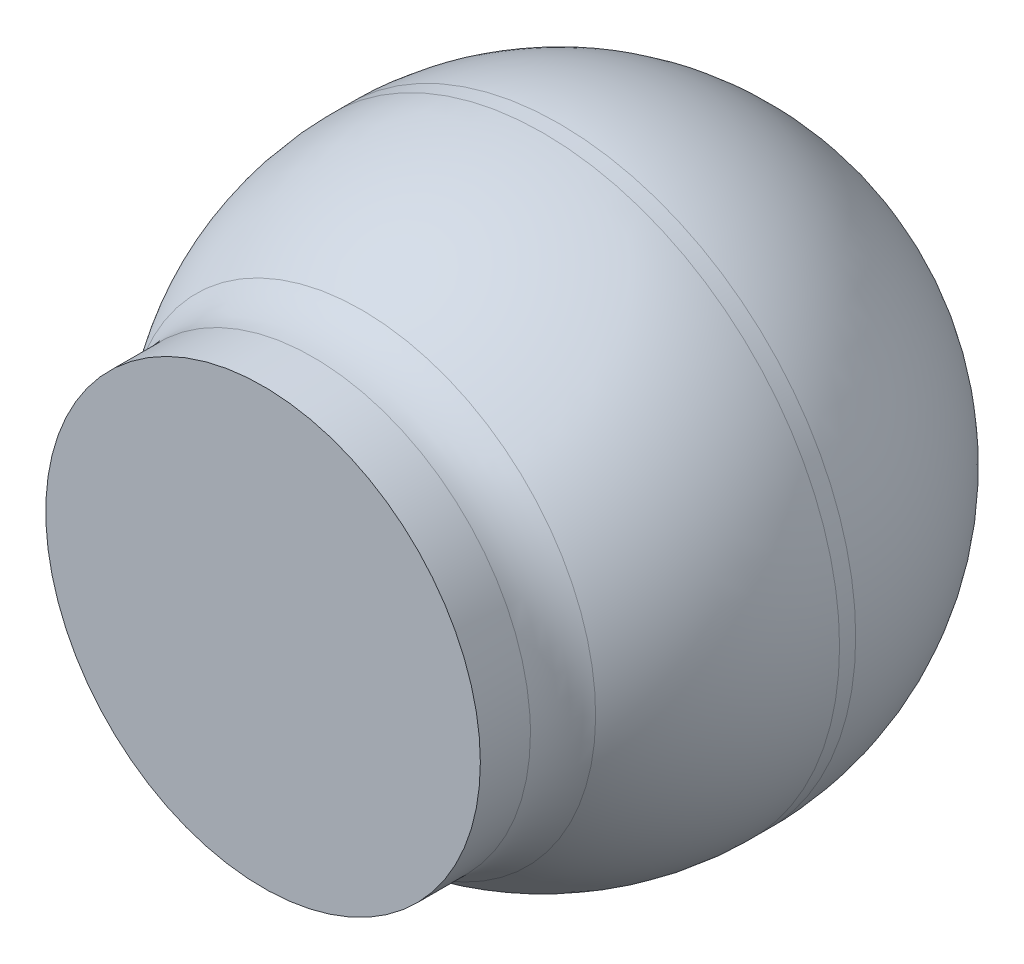
ISO-10303-21;
HEADER;
FILE_DESCRIPTION(('STEP AP214'),'2;1');
FILE_NAME('part.step','',(''),(''),'','','');
FILE_SCHEMA(('AUTOMOTIVE_DESIGN { 1 0 10303 214 1 1 1 1 }'));
ENDSEC;
DATA;
#1=APPLICATION_CONTEXT('core data for automotive mechanical design processes');
#2=APPLICATION_PROTOCOL_DEFINITION('international standard','automotive_design',2000,#1);
#3=PRODUCT_CONTEXT('',#1,'mechanical');
#4=PRODUCT('Part','Part','',(#3));
#5=PRODUCT_RELATED_PRODUCT_CATEGORY('part','',(#4));
#6=PRODUCT_DEFINITION_FORMATION('','',#4);
#7=PRODUCT_DEFINITION_CONTEXT('part definition',#1,'design');
#8=PRODUCT_DEFINITION('design','',#6,#7);
#9=PRODUCT_DEFINITION_SHAPE('','',#8);
#10=(LENGTH_UNIT() NAMED_UNIT(*) SI_UNIT(.MILLI.,.METRE.));
#11=(NAMED_UNIT(*) PLANE_ANGLE_UNIT() SI_UNIT($,.RADIAN.));
#12=(NAMED_UNIT(*) SI_UNIT($,.STERADIAN.) SOLID_ANGLE_UNIT());
#13=UNCERTAINTY_MEASURE_WITH_UNIT(LENGTH_MEASURE(1.E-05),#10,'distance_accuracy_value','');
#14=(GEOMETRIC_REPRESENTATION_CONTEXT(3) GLOBAL_UNCERTAINTY_ASSIGNED_CONTEXT((#13)) GLOBAL_UNIT_ASSIGNED_CONTEXT((#10,
#11,#12)) REPRESENTATION_CONTEXT('',''));
#15=CARTESIAN_POINT('',(0.,0.,0.));
#16=DIRECTION('',(0.,0.,1.));
#17=DIRECTION('',(1.,0.,0.));
#18=AXIS2_PLACEMENT_3D('',#15,#16,#17);
#19=CARTESIAN_POINT('',(-6.912919922269,-11.67134929145,10.006534503384));
#20=DIRECTION('',(0.,0.,-1.));
#21=DIRECTION('',(-1.,0.,0.));
#22=AXIS2_PLACEMENT_3D('',#19,#20,#21);
#23=PLANE('',#22);
#24=CARTESIAN_POINT('',(-6.912919922269,-11.67134929145,10.006534503384));
#25=DIRECTION('',(0.,0.,1.));
#26=DIRECTION('',(1.,0.,0.));
#27=AXIS2_PLACEMENT_3D('',#24,#25,#26);
#28=CIRCLE('',#27,0.275);
#29=CARTESIAN_POINT('',(-6.637919922269,-11.67134929145,10.006534503384));
#30=VERTEX_POINT('',#29);
#31=EDGE_CURVE('E20',#30,#30,#28,.F.);
#32=ORIENTED_EDGE('',*,*,#31,.F.);
#33=EDGE_LOOP('',(#32));
#34=FACE_BOUND('',#33,.T.);
#35=ADVANCED_FACE('F17',(#34),#23,.F.);
#36=CARTESIAN_POINT('',(-6.912919922269,-11.67134929145,9.906534503384));
#37=DIRECTION('',(0.,0.,1.));
#38=DIRECTION('',(1.,0.,0.));
#39=AXIS2_PLACEMENT_3D('',#36,#37,#38);
#40=CYLINDRICAL_SURFACE('',#39,0.275);
#41=CARTESIAN_POINT('',(-6.912919922269,-11.67134929145,9.943180457728));
#42=DIRECTION('',(0.,0.,-1.));
#43=DIRECTION('',(0.996700902337582,0.081162252799247,0.));
#44=AXIS2_PLACEMENT_3D('',#41,#42,#43);
#45=CIRCLE('',#44,0.275);
#46=CARTESIAN_POINT('',(-6.63882717412617,-11.6490296719302,9.943180457728));
#47=VERTEX_POINT('',#46);
#48=EDGE_CURVE('E66',#47,#47,#45,.F.);
#49=ORIENTED_EDGE('',*,*,#48,.T.);
#50=EDGE_LOOP('',(#49));
#51=FACE_BOUND('',#50,.T.);
#52=ORIENTED_EDGE('',*,*,#31,.T.);
#53=EDGE_LOOP('',(#52));
#54=FACE_BOUND('',#53,.T.);
#55=ADVANCED_FACE('F62',(#51,#54),#40,.T.);
#56=CARTESIAN_POINT('',(-6.912919922269,-11.67134929145,9.943180457728));
#57=DIRECTION('',(0.,0.,-1.));
#58=DIRECTION('',(0.996700902337583,0.0811622527992448,0.));
#59=AXIS2_PLACEMENT_3D('',#56,#57,#58);
#60=TOROIDAL_SURFACE('',#59,0.375,0.1);
#61=ORIENTED_EDGE('',*,*,#48,.F.);
#62=EDGE_LOOP('',(#61));
#63=FACE_BOUND('',#62,.T.);
#64=CARTESIAN_POINT('',(-6.912919922269,-11.67134929145,9.881744931236));
#65=DIRECTION('',(0.,0.,-1.));
#66=DIRECTION('',(-0.996700902338691,-0.0811622527856354,0.));
#67=AXIS2_PLACEMENT_3D('',#64,#65,#66);
#68=CIRCLE('',#67,0.29609704641234);
#69=CARTESIAN_POINT('',(-7.208040115608,-11.69538119478,9.881744931236));
#70=VERTEX_POINT('',#69);
#71=EDGE_CURVE('E39',#70,#70,#68,.T.);
#72=ORIENTED_EDGE('',*,*,#71,.F.);
#73=EDGE_LOOP('',(#72));
#74=FACE_BOUND('',#73,.T.);
#75=ADVANCED_FACE('F57',(#63,#74),#60,.F.);
#76=CARTESIAN_POINT('',(-7.286682760645,-11.70178513625,9.651976062157));
#77=CARTESIAN_POINT('',(-7.286682760645,-11.70178513625,9.701461392103));
#78=CARTESIAN_POINT('',(-7.278526217348,-11.70112094157,9.750947004335));
#79=CARTESIAN_POINT('',(-7.262207085349,-11.69979205995,9.798626332798));
#80=CARTESIAN_POINT('',(-7.238341390838,-11.69784865493,9.842699544317));
#81=CARTESIAN_POINT('',(-7.208040115608,-11.69538119478,9.881744931236));
#82=(BOUNDED_CURVE() B_SPLINE_CURVE(5,(#76,#77,#78,#79,#80,#81),.UNSPECIFIED.,.F.,
.F.) B_SPLINE_CURVE_WITH_KNOTS((6,6),(0.,0.661568582165),
.UNSPECIFIED.) CURVE() GEOMETRIC_REPRESENTATION_ITEM() RATIONAL_B_SPLINE_CURVE((1.,1.,1.,1.,1.,1.)) REPRESENTATION_ITEM(''));
#83=CARTESIAN_POINT('',(-6.912919922269,-11.67134929145,9.651976062157));
#84=DIRECTION('',(0.,0.,-1.));
#85=AXIS1_PLACEMENT('',#83,#84);
#86=SURFACE_OF_REVOLUTION('',#82,#85);
#87=CARTESIAN_POINT('',(-6.912919922269,-11.67134929145,9.651976062157));
#88=DIRECTION('',(0.,0.,1.));
#89=DIRECTION('',(1.,0.,0.));
#90=AXIS2_PLACEMENT_3D('',#87,#88,#89);
#91=CIRCLE('',#90,0.375);
#92=CARTESIAN_POINT('',(-6.537919922269,-11.67134929145,9.651976062157));
#93=VERTEX_POINT('',#92);
#94=EDGE_CURVE('E36',#93,#93,#91,.F.);
#95=ORIENTED_EDGE('',*,*,#94,.F.);
#96=EDGE_LOOP('',(#95));
#97=FACE_BOUND('',#96,.T.);
#98=ORIENTED_EDGE('',*,*,#71,.T.);
#99=EDGE_LOOP('',(#98));
#100=FACE_BOUND('',#99,.T.);
#101=ADVANCED_FACE('F53',(#97,#100),#86,.F.);
#102=CARTESIAN_POINT('',(-6.912919922269,-11.67134929145,9.256534503384));
#103=DIRECTION('',(0.,0.,1.));
#104=DIRECTION('',(1.,0.,0.));
#105=AXIS2_PLACEMENT_3D('',#102,#103,#104);
#106=CYLINDRICAL_SURFACE('',#105,0.375);
#107=CARTESIAN_POINT('',(-6.912919922269,-11.67134929145,9.631534503384));
#108=DIRECTION('',(0.,0.,-1.));
#109=DIRECTION('',(0.0811622527992357,-0.996700902337583,0.));
#110=AXIS2_PLACEMENT_3D('',#107,#108,#109);
#111=CIRCLE('',#110,0.375);
#112=CARTESIAN_POINT('',(-6.88248407746929,-12.0451121298266,9.631534503384));
#113=VERTEX_POINT('',#112);
#114=CARTESIAN_POINT('',(-6.94335576706871,-11.2975864530734,9.631534503384));
#115=VERTEX_POINT('',#114);
#116=EDGE_CURVE('E11',#113,#115,#111,.T.);
#117=ORIENTED_EDGE('',*,*,#116,.F.);
#118=CARTESIAN_POINT('',(-6.912919922269,-11.67134929145,9.631534503384));
#119=DIRECTION('',(3.33436315446763E-12,2.72100352061447E-13,1.));
#120=DIRECTION('',(0.0811622527992365,-0.996700902337583,0.));
#121=AXIS2_PLACEMENT_3D('',#118,#119,#120);
#122=CIRCLE('',#121,0.375);
#123=EDGE_CURVE('E25',#115,#113,#122,.F.);
#124=ORIENTED_EDGE('',*,*,#123,.F.);
#125=EDGE_LOOP('',(#117,#124));
#126=FACE_BOUND('',#125,.T.);
#127=ORIENTED_EDGE('',*,*,#94,.T.);
#128=EDGE_LOOP('',(#127));
#129=FACE_BOUND('',#128,.T.);
#130=ADVANCED_FACE('F34',(#126,#129),#106,.T.);
#131=CARTESIAN_POINT('',(-6.912919922269,-11.67134929145,9.631534503384));
#132=DIRECTION('',(0.0811622527992361,-0.996700902337583,0.));
#133=DIRECTION('',(-0.996700902337583,-0.0811622527992361,0.));
#134=AXIS2_PLACEMENT_3D('',#131,#132,#133);
#135=SPHERICAL_SURFACE('',#134,0.375);
#136=ORIENTED_EDGE('',*,*,#123,.T.);
#137=ORIENTED_EDGE('',*,*,#116,.T.);
#138=EDGE_LOOP('',(#136,#137));
#139=FACE_BOUND('',#138,.T.);
#140=ADVANCED_FACE('F32',(#139),#135,.T.);
#141=CLOSED_SHELL('',(#35,#55,#75,#101,#130,#140));
#142=MANIFOLD_SOLID_BREP('B1',#141);
#143=ADVANCED_BREP_SHAPE_REPRESENTATION('',(#18,#142),#14);
#144=SHAPE_DEFINITION_REPRESENTATION(#9,#143);
ENDSEC;
END-ISO-10303-21;
